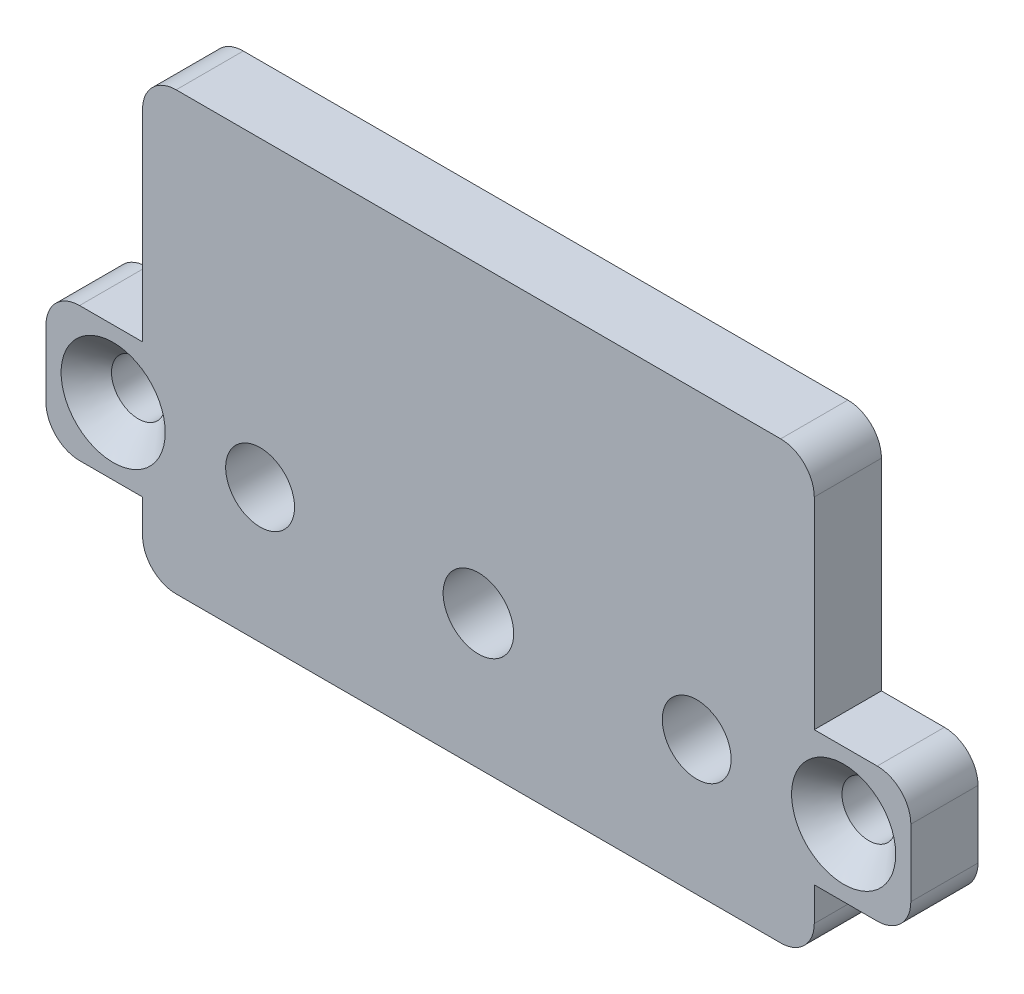
ISO-10303-21;
HEADER;
FILE_DESCRIPTION(('STEP AP214'),'2;1');
FILE_NAME('part.step','',(''),(''),'','','');
FILE_SCHEMA(('AUTOMOTIVE_DESIGN { 1 0 10303 214 1 1 1 1 }'));
ENDSEC;
DATA;
#1=APPLICATION_CONTEXT('core data for automotive mechanical design processes');
#2=APPLICATION_PROTOCOL_DEFINITION('international standard','automotive_design',2000,#1);
#3=PRODUCT_CONTEXT('',#1,'mechanical');
#4=PRODUCT('Part','Part','',(#3));
#5=PRODUCT_RELATED_PRODUCT_CATEGORY('part','',(#4));
#6=PRODUCT_DEFINITION_FORMATION('','',#4);
#7=PRODUCT_DEFINITION_CONTEXT('part definition',#1,'design');
#8=PRODUCT_DEFINITION('design','',#6,#7);
#9=PRODUCT_DEFINITION_SHAPE('','',#8);
#10=(LENGTH_UNIT() NAMED_UNIT(*) SI_UNIT(.MILLI.,.METRE.));
#11=(NAMED_UNIT(*) PLANE_ANGLE_UNIT() SI_UNIT($,.RADIAN.));
#12=(NAMED_UNIT(*) SI_UNIT($,.STERADIAN.) SOLID_ANGLE_UNIT());
#13=UNCERTAINTY_MEASURE_WITH_UNIT(LENGTH_MEASURE(1.E-05),#10,'distance_accuracy_value','');
#14=(GEOMETRIC_REPRESENTATION_CONTEXT(3) GLOBAL_UNCERTAINTY_ASSIGNED_CONTEXT((#13)) GLOBAL_UNIT_ASSIGNED_CONTEXT((#10,
#11,#12)) REPRESENTATION_CONTEXT('',''));
#15=CARTESIAN_POINT('',(0.,0.,0.));
#16=DIRECTION('',(0.,0.,1.));
#17=DIRECTION('',(1.,0.,0.));
#18=AXIS2_PLACEMENT_3D('',#15,#16,#17);
#19=CARTESIAN_POINT('',(0.,0.,4.));
#20=DIRECTION('',(0.,1.,0.));
#21=DIRECTION('',(0.,0.,1.));
#22=AXIS2_PLACEMENT_3D('',#19,#20,#21);
#23=PLANE('',#22);
#24=DIRECTION('',(1.,0.,0.));
#25=VECTOR('',#24,1.);
#26=CARTESIAN_POINT('',(0.,0.,4.));
#27=LINE('',#26,#25);
#28=CARTESIAN_POINT('',(2.,0.,4.));
#29=VERTEX_POINT('',#28);
#30=CARTESIAN_POINT('',(5.75,0.,4.));
#31=VERTEX_POINT('',#30);
#32=EDGE_CURVE('E189',#29,#31,#27,.T.);
#33=ORIENTED_EDGE('',*,*,#32,.F.);
#34=DIRECTION('',(0.,0.,-1.));
#35=VECTOR('',#34,1.);
#36=CARTESIAN_POINT('',(2.,0.,0.));
#37=LINE('',#36,#35);
#38=CARTESIAN_POINT('',(2.,0.,0.));
#39=VERTEX_POINT('',#38);
#40=EDGE_CURVE('E253',#29,#39,#37,.T.);
#41=ORIENTED_EDGE('',*,*,#40,.T.);
#42=DIRECTION('',(1.,0.,0.));
#43=VECTOR('',#42,1.);
#44=CARTESIAN_POINT('',(0.,0.,0.));
#45=LINE('',#44,#43);
#46=CARTESIAN_POINT('',(5.75,0.,0.));
#47=VERTEX_POINT('',#46);
#48=EDGE_CURVE('E206',#39,#47,#45,.T.);
#49=ORIENTED_EDGE('',*,*,#48,.T.);
#50=DIRECTION('',(0.,0.,-1.));
#51=VECTOR('',#50,1.);
#52=CARTESIAN_POINT('',(5.75,0.,4.));
#53=LINE('',#52,#51);
#54=EDGE_CURVE('E185',#31,#47,#53,.T.);
#55=ORIENTED_EDGE('',*,*,#54,.F.);
#56=EDGE_LOOP('',(#33,#41,#49,#55));
#57=FACE_BOUND('',#56,.T.);
#58=ADVANCED_FACE('F43',(#57),#23,.F.);
#59=CARTESIAN_POINT('',(5.75,0.,4.));
#60=DIRECTION('',(-1.,0.,0.));
#61=DIRECTION('',(0.,0.,1.));
#62=AXIS2_PLACEMENT_3D('',#59,#60,#61);
#63=PLANE('',#62);
#64=DIRECTION('',(0.,1.,0.));
#65=VECTOR('',#64,1.);
#66=CARTESIAN_POINT('',(5.75,0.,0.));
#67=LINE('',#66,#65);
#68=CARTESIAN_POINT('',(5.75,-2.,0.));
#69=VERTEX_POINT('',#68);
#70=EDGE_CURVE('E422',#69,#47,#67,.T.);
#71=ORIENTED_EDGE('',*,*,#70,.F.);
#72=DIRECTION('',(0.,0.,-1.));
#73=VECTOR('',#72,1.);
#74=CARTESIAN_POINT('',(5.75,-2.,4.));
#75=LINE('',#74,#73);
#76=CARTESIAN_POINT('',(5.75,-2.,4.));
#77=VERTEX_POINT('',#76);
#78=EDGE_CURVE('E59',#69,#77,#75,.F.);
#79=ORIENTED_EDGE('',*,*,#78,.T.);
#80=DIRECTION('',(0.,1.,0.));
#81=VECTOR('',#80,1.);
#82=CARTESIAN_POINT('',(5.75,0.,4.));
#83=LINE('',#82,#81);
#84=EDGE_CURVE('E181',#77,#31,#83,.T.);
#85=ORIENTED_EDGE('',*,*,#84,.T.);
#86=ORIENTED_EDGE('',*,*,#54,.T.);
#87=EDGE_LOOP('',(#71,#79,#85,#86));
#88=FACE_BOUND('',#87,.T.);
#89=ADVANCED_FACE('F183',(#88),#63,.T.);
#90=CARTESIAN_POINT('',(0.,-4.,4.));
#91=DIRECTION('',(0.,1.,0.));
#92=DIRECTION('',(0.,0.,1.));
#93=AXIS2_PLACEMENT_3D('',#90,#91,#92);
#94=PLANE('',#93);
#95=DIRECTION('',(1.,0.,0.));
#96=VECTOR('',#95,1.);
#97=CARTESIAN_POINT('',(0.,-4.,0.));
#98=LINE('',#97,#96);
#99=CARTESIAN_POINT('',(7.75,-4.,0.));
#100=VERTEX_POINT('',#99);
#101=CARTESIAN_POINT('',(43.75,-4.,0.));
#102=VERTEX_POINT('',#101);
#103=EDGE_CURVE('E418',#100,#102,#98,.T.);
#104=ORIENTED_EDGE('',*,*,#103,.T.);
#105=DIRECTION('',(0.,0.,-1.));
#106=VECTOR('',#105,1.);
#107=CARTESIAN_POINT('',(43.75,-4.,4.));
#108=LINE('',#107,#106);
#109=CARTESIAN_POINT('',(43.75,-4.,4.));
#110=VERTEX_POINT('',#109);
#111=EDGE_CURVE('E302',#102,#110,#108,.F.);
#112=ORIENTED_EDGE('',*,*,#111,.T.);
#113=DIRECTION('',(1.,0.,0.));
#114=VECTOR('',#113,1.);
#115=CARTESIAN_POINT('',(0.,-4.,4.));
#116=LINE('',#115,#114);
#117=CARTESIAN_POINT('',(7.75,-4.,4.));
#118=VERTEX_POINT('',#117);
#119=EDGE_CURVE('E188',#118,#110,#116,.T.);
#120=ORIENTED_EDGE('',*,*,#119,.F.);
#121=DIRECTION('',(0.,0.,-1.));
#122=VECTOR('',#121,1.);
#123=CARTESIAN_POINT('',(7.75,-4.,0.));
#124=LINE('',#123,#122);
#125=EDGE_CURVE('E298',#118,#100,#124,.T.);
#126=ORIENTED_EDGE('',*,*,#125,.T.);
#127=EDGE_LOOP('',(#104,#112,#120,#126));
#128=FACE_BOUND('',#127,.T.);
#129=ADVANCED_FACE('F509',(#128),#94,.F.);
#130=CARTESIAN_POINT('',(45.75,0.,4.));
#131=DIRECTION('',(-1.,0.,0.));
#132=DIRECTION('',(0.,0.,1.));
#133=AXIS2_PLACEMENT_3D('',#130,#131,#132);
#134=PLANE('',#133);
#135=DIRECTION('',(0.,1.,0.));
#136=VECTOR('',#135,1.);
#137=CARTESIAN_POINT('',(45.75,0.,4.));
#138=LINE('',#137,#136);
#139=CARTESIAN_POINT('',(45.75,-2.,4.));
#140=VERTEX_POINT('',#139);
#141=CARTESIAN_POINT('',(45.75,0.,4.));
#142=VERTEX_POINT('',#141);
#143=EDGE_CURVE('E464',#140,#142,#138,.T.);
#144=ORIENTED_EDGE('',*,*,#143,.F.);
#145=DIRECTION('',(0.,0.,-1.));
#146=VECTOR('',#145,1.);
#147=CARTESIAN_POINT('',(45.75,-2.,4.));
#148=LINE('',#147,#146);
#149=CARTESIAN_POINT('',(45.75,-2.,0.));
#150=VERTEX_POINT('',#149);
#151=EDGE_CURVE('E282',#140,#150,#148,.T.);
#152=ORIENTED_EDGE('',*,*,#151,.T.);
#153=DIRECTION('',(0.,1.,0.));
#154=VECTOR('',#153,1.);
#155=CARTESIAN_POINT('',(45.75,0.,0.));
#156=LINE('',#155,#154);
#157=CARTESIAN_POINT('',(45.75,0.,0.));
#158=VERTEX_POINT('',#157);
#159=EDGE_CURVE('E415',#150,#158,#156,.T.);
#160=ORIENTED_EDGE('',*,*,#159,.T.);
#161=DIRECTION('',(0.,0.,-1.));
#162=VECTOR('',#161,1.);
#163=CARTESIAN_POINT('',(45.75,0.,4.));
#164=LINE('',#163,#162);
#165=EDGE_CURVE('E209',#142,#158,#164,.T.);
#166=ORIENTED_EDGE('',*,*,#165,.F.);
#167=EDGE_LOOP('',(#144,#152,#160,#166));
#168=FACE_BOUND('',#167,.T.);
#169=ADVANCED_FACE('F478',(#168),#134,.F.);
#170=CARTESIAN_POINT('',(0.,0.,4.));
#171=DIRECTION('',(0.,1.,0.));
#172=DIRECTION('',(0.,0.,1.));
#173=AXIS2_PLACEMENT_3D('',#170,#171,#172);
#174=PLANE('',#173);
#175=DIRECTION('',(1.,0.,0.));
#176=VECTOR('',#175,1.);
#177=CARTESIAN_POINT('',(0.,0.,0.));
#178=LINE('',#177,#176);
#179=CARTESIAN_POINT('',(49.5,0.,0.));
#180=VERTEX_POINT('',#179);
#181=EDGE_CURVE('E409',#158,#180,#178,.T.);
#182=ORIENTED_EDGE('',*,*,#181,.T.);
#183=DIRECTION('',(0.,0.,-1.));
#184=VECTOR('',#183,1.);
#185=CARTESIAN_POINT('',(49.5,0.,4.));
#186=LINE('',#185,#184);
#187=CARTESIAN_POINT('',(49.5,0.,4.));
#188=VERTEX_POINT('',#187);
#189=EDGE_CURVE('E235',#180,#188,#186,.F.);
#190=ORIENTED_EDGE('',*,*,#189,.T.);
#191=DIRECTION('',(1.,0.,0.));
#192=VECTOR('',#191,1.);
#193=CARTESIAN_POINT('',(0.,0.,4.));
#194=LINE('',#193,#192);
#195=EDGE_CURVE('E460',#142,#188,#194,.T.);
#196=ORIENTED_EDGE('',*,*,#195,.F.);
#197=ORIENTED_EDGE('',*,*,#165,.T.);
#198=EDGE_LOOP('',(#182,#190,#196,#197));
#199=FACE_BOUND('',#198,.T.);
#200=ADVANCED_FACE('F485',(#199),#174,.F.);
#201=CARTESIAN_POINT('',(51.5,0.,4.));
#202=DIRECTION('',(-1.,0.,0.));
#203=DIRECTION('',(0.,0.,1.));
#204=AXIS2_PLACEMENT_3D('',#201,#202,#203);
#205=PLANE('',#204);
#206=DIRECTION('',(0.,1.,0.));
#207=VECTOR('',#206,1.);
#208=CARTESIAN_POINT('',(51.5,0.,4.));
#209=LINE('',#208,#207);
#210=CARTESIAN_POINT('',(51.5,2.,4.));
#211=VERTEX_POINT('',#210);
#212=CARTESIAN_POINT('',(51.5,6.,4.));
#213=VERTEX_POINT('',#212);
#214=EDGE_CURVE('E456',#211,#213,#209,.T.);
#215=ORIENTED_EDGE('',*,*,#214,.F.);
#216=DIRECTION('',(0.,0.,-1.));
#217=VECTOR('',#216,1.);
#218=CARTESIAN_POINT('',(51.5,2.,4.));
#219=LINE('',#218,#217);
#220=CARTESIAN_POINT('',(51.5,2.,0.));
#221=VERTEX_POINT('',#220);
#222=EDGE_CURVE('E213',#211,#221,#219,.T.);
#223=ORIENTED_EDGE('',*,*,#222,.T.);
#224=DIRECTION('',(0.,1.,0.));
#225=VECTOR('',#224,1.);
#226=CARTESIAN_POINT('',(51.5,0.,0.));
#227=LINE('',#226,#225);
#228=CARTESIAN_POINT('',(51.5,6.,0.));
#229=VERTEX_POINT('',#228);
#230=EDGE_CURVE('E405',#221,#229,#227,.T.);
#231=ORIENTED_EDGE('',*,*,#230,.T.);
#232=DIRECTION('',(0.,0.,-1.));
#233=VECTOR('',#232,1.);
#234=CARTESIAN_POINT('',(51.5,6.,4.));
#235=LINE('',#234,#233);
#236=EDGE_CURVE('E208',#229,#213,#235,.F.);
#237=ORIENTED_EDGE('',*,*,#236,.T.);
#238=EDGE_LOOP('',(#215,#223,#231,#237));
#239=FACE_BOUND('',#238,.T.);
#240=ADVANCED_FACE('F494',(#239),#205,.F.);
#241=CARTESIAN_POINT('',(0.,8.,4.));
#242=DIRECTION('',(0.,1.,0.));
#243=DIRECTION('',(0.,0.,1.));
#244=AXIS2_PLACEMENT_3D('',#241,#242,#243);
#245=PLANE('',#244);
#246=DIRECTION('',(1.,0.,0.));
#247=VECTOR('',#246,1.);
#248=CARTESIAN_POINT('',(0.,8.,4.));
#249=LINE('',#248,#247);
#250=CARTESIAN_POINT('',(45.75,8.,4.));
#251=VERTEX_POINT('',#250);
#252=CARTESIAN_POINT('',(49.5,8.,4.));
#253=VERTEX_POINT('',#252);
#254=EDGE_CURVE('E453',#251,#253,#249,.T.);
#255=ORIENTED_EDGE('',*,*,#254,.T.);
#256=DIRECTION('',(0.,0.,-1.));
#257=VECTOR('',#256,1.);
#258=CARTESIAN_POINT('',(49.5,8.,0.));
#259=LINE('',#258,#257);
#260=CARTESIAN_POINT('',(49.5,8.,0.));
#261=VERTEX_POINT('',#260);
#262=EDGE_CURVE('E249',#253,#261,#259,.T.);
#263=ORIENTED_EDGE('',*,*,#262,.T.);
#264=DIRECTION('',(1.,0.,0.));
#265=VECTOR('',#264,1.);
#266=CARTESIAN_POINT('',(0.,8.,0.));
#267=LINE('',#266,#265);
#268=CARTESIAN_POINT('',(45.75,8.,0.));
#269=VERTEX_POINT('',#268);
#270=EDGE_CURVE('E400',#269,#261,#267,.T.);
#271=ORIENTED_EDGE('',*,*,#270,.F.);
#272=DIRECTION('',(0.,0.,-1.));
#273=VECTOR('',#272,1.);
#274=CARTESIAN_POINT('',(45.75,8.,4.));
#275=LINE('',#274,#273);
#276=EDGE_CURVE('E216',#251,#269,#275,.T.);
#277=ORIENTED_EDGE('',*,*,#276,.F.);
#278=EDGE_LOOP('',(#255,#263,#271,#277));
#279=FACE_BOUND('',#278,.T.);
#280=ADVANCED_FACE('F402',(#279),#245,.T.);
#281=CARTESIAN_POINT('',(45.75,0.,4.));
#282=DIRECTION('',(-1.,0.,0.));
#283=DIRECTION('',(0.,0.,1.));
#284=AXIS2_PLACEMENT_3D('',#281,#282,#283);
#285=PLANE('',#284);
#286=DIRECTION('',(0.,1.,0.));
#287=VECTOR('',#286,1.);
#288=CARTESIAN_POINT('',(45.75,0.,0.));
#289=LINE('',#288,#287);
#290=CARTESIAN_POINT('',(45.75,20.,0.));
#291=VERTEX_POINT('',#290);
#292=EDGE_CURVE('E363',#269,#291,#289,.T.);
#293=ORIENTED_EDGE('',*,*,#292,.T.);
#294=DIRECTION('',(0.,0.,-1.));
#295=VECTOR('',#294,1.);
#296=CARTESIAN_POINT('',(45.75,20.,4.));
#297=LINE('',#296,#295);
#298=CARTESIAN_POINT('',(45.75,20.,4.));
#299=VERTEX_POINT('',#298);
#300=EDGE_CURVE('E11',#291,#299,#297,.F.);
#301=ORIENTED_EDGE('',*,*,#300,.T.);
#302=DIRECTION('',(0.,1.,0.));
#303=VECTOR('',#302,1.);
#304=CARTESIAN_POINT('',(45.75,0.,4.));
#305=LINE('',#304,#303);
#306=EDGE_CURVE('E340',#251,#299,#305,.T.);
#307=ORIENTED_EDGE('',*,*,#306,.F.);
#308=ORIENTED_EDGE('',*,*,#276,.T.);
#309=EDGE_LOOP('',(#293,#301,#307,#308));
#310=FACE_BOUND('',#309,.T.);
#311=ADVANCED_FACE('F393',(#310),#285,.F.);
#312=CARTESIAN_POINT('',(0.,22.,4.));
#313=DIRECTION('',(0.,1.,0.));
#314=DIRECTION('',(0.,0.,1.));
#315=AXIS2_PLACEMENT_3D('',#312,#313,#314);
#316=PLANE('',#315);
#317=DIRECTION('',(1.,0.,0.));
#318=VECTOR('',#317,1.);
#319=CARTESIAN_POINT('',(0.,22.,0.));
#320=LINE('',#319,#318);
#321=CARTESIAN_POINT('',(7.75,22.,0.));
#322=VERTEX_POINT('',#321);
#323=CARTESIAN_POINT('',(43.75,22.,0.));
#324=VERTEX_POINT('',#323);
#325=EDGE_CURVE('E334',#322,#324,#320,.T.);
#326=ORIENTED_EDGE('',*,*,#325,.F.);
#327=DIRECTION('',(0.,0.,-1.));
#328=VECTOR('',#327,1.);
#329=CARTESIAN_POINT('',(7.75,22.,4.));
#330=LINE('',#329,#328);
#331=CARTESIAN_POINT('',(7.75,22.,4.));
#332=VERTEX_POINT('',#331);
#333=EDGE_CURVE('E52',#322,#332,#330,.F.);
#334=ORIENTED_EDGE('',*,*,#333,.T.);
#335=DIRECTION('',(1.,0.,0.));
#336=VECTOR('',#335,1.);
#337=CARTESIAN_POINT('',(0.,22.,4.));
#338=LINE('',#337,#336);
#339=CARTESIAN_POINT('',(43.75,22.,4.));
#340=VERTEX_POINT('',#339);
#341=EDGE_CURVE('E331',#332,#340,#338,.T.);
#342=ORIENTED_EDGE('',*,*,#341,.T.);
#343=DIRECTION('',(0.,0.,-1.));
#344=VECTOR('',#343,1.);
#345=CARTESIAN_POINT('',(43.75,22.,0.));
#346=LINE('',#345,#344);
#347=EDGE_CURVE('E322',#340,#324,#346,.T.);
#348=ORIENTED_EDGE('',*,*,#347,.T.);
#349=EDGE_LOOP('',(#326,#334,#342,#348));
#350=FACE_BOUND('',#349,.T.);
#351=ADVANCED_FACE('F330',(#350),#316,.T.);
#352=CARTESIAN_POINT('',(5.75,0.,4.));
#353=DIRECTION('',(-1.,0.,0.));
#354=DIRECTION('',(0.,0.,1.));
#355=AXIS2_PLACEMENT_3D('',#352,#353,#354);
#356=PLANE('',#355);
#357=DIRECTION('',(0.,1.,0.));
#358=VECTOR('',#357,1.);
#359=CARTESIAN_POINT('',(5.75,0.,4.));
#360=LINE('',#359,#358);
#361=CARTESIAN_POINT('',(5.75,8.,4.));
#362=VERTEX_POINT('',#361);
#363=CARTESIAN_POINT('',(5.75,20.,4.));
#364=VERTEX_POINT('',#363);
#365=EDGE_CURVE('E339',#362,#364,#360,.T.);
#366=ORIENTED_EDGE('',*,*,#365,.T.);
#367=DIRECTION('',(0.,0.,-1.));
#368=VECTOR('',#367,1.);
#369=CARTESIAN_POINT('',(5.75,20.,4.));
#370=LINE('',#369,#368);
#371=CARTESIAN_POINT('',(5.75,20.,0.));
#372=VERTEX_POINT('',#371);
#373=EDGE_CURVE('E318',#364,#372,#370,.T.);
#374=ORIENTED_EDGE('',*,*,#373,.T.);
#375=DIRECTION('',(0.,1.,0.));
#376=VECTOR('',#375,1.);
#377=CARTESIAN_POINT('',(5.75,0.,0.));
#378=LINE('',#377,#376);
#379=CARTESIAN_POINT('',(5.75,8.,0.));
#380=VERTEX_POINT('',#379);
#381=EDGE_CURVE('E349',#380,#372,#378,.T.);
#382=ORIENTED_EDGE('',*,*,#381,.F.);
#383=DIRECTION('',(0.,0.,-1.));
#384=VECTOR('',#383,1.);
#385=CARTESIAN_POINT('',(5.75,8.,4.));
#386=LINE('',#385,#384);
#387=EDGE_CURVE('E385',#362,#380,#386,.T.);
#388=ORIENTED_EDGE('',*,*,#387,.F.);
#389=EDGE_LOOP('',(#366,#374,#382,#388));
#390=FACE_BOUND('',#389,.T.);
#391=ADVANCED_FACE('F347',(#390),#356,.T.);
#392=CARTESIAN_POINT('',(0.,8.,4.));
#393=DIRECTION('',(0.,1.,0.));
#394=DIRECTION('',(0.,0.,1.));
#395=AXIS2_PLACEMENT_3D('',#392,#393,#394);
#396=PLANE('',#395);
#397=DIRECTION('',(1.,0.,0.));
#398=VECTOR('',#397,1.);
#399=CARTESIAN_POINT('',(0.,8.,0.));
#400=LINE('',#399,#398);
#401=CARTESIAN_POINT('',(2.,8.,0.));
#402=VERTEX_POINT('',#401);
#403=EDGE_CURVE('E355',#402,#380,#400,.T.);
#404=ORIENTED_EDGE('',*,*,#403,.F.);
#405=DIRECTION('',(0.,0.,-1.));
#406=VECTOR('',#405,1.);
#407=CARTESIAN_POINT('',(2.,8.,4.));
#408=LINE('',#407,#406);
#409=CARTESIAN_POINT('',(2.,8.,4.));
#410=VERTEX_POINT('',#409);
#411=EDGE_CURVE('E263',#402,#410,#408,.F.);
#412=ORIENTED_EDGE('',*,*,#411,.T.);
#413=DIRECTION('',(1.,0.,0.));
#414=VECTOR('',#413,1.);
#415=CARTESIAN_POINT('',(0.,8.,4.));
#416=LINE('',#415,#414);
#417=EDGE_CURVE('E446',#410,#362,#416,.T.);
#418=ORIENTED_EDGE('',*,*,#417,.T.);
#419=ORIENTED_EDGE('',*,*,#387,.T.);
#420=EDGE_LOOP('',(#404,#412,#418,#419));
#421=FACE_BOUND('',#420,.T.);
#422=ADVANCED_FACE('F552',(#421),#396,.T.);
#423=CARTESIAN_POINT('',(38.75,4.,4.));
#424=DIRECTION('',(0.,0.,-1.));
#425=DIRECTION('',(-1.,0.,0.));
#426=AXIS2_PLACEMENT_3D('',#423,#424,#425);
#427=CYLINDRICAL_SURFACE('',#426,2.05);
#428=CARTESIAN_POINT('',(38.75,4.,4.));
#429=DIRECTION('',(0.,0.,1.));
#430=DIRECTION('',(1.,0.,0.));
#431=AXIS2_PLACEMENT_3D('',#428,#429,#430);
#432=CIRCLE('',#431,2.05);
#433=CARTESIAN_POINT('',(40.8,4.,4.));
#434=VERTEX_POINT('',#433);
#435=EDGE_CURVE('E387',#434,#434,#432,.T.);
#436=ORIENTED_EDGE('',*,*,#435,.T.);
#437=EDGE_LOOP('',(#436));
#438=FACE_BOUND('',#437,.T.);
#439=CARTESIAN_POINT('',(38.75,4.,0.));
#440=DIRECTION('',(0.,0.,1.));
#441=DIRECTION('',(1.,0.,0.));
#442=AXIS2_PLACEMENT_3D('',#439,#440,#441);
#443=CIRCLE('',#442,2.05);
#444=CARTESIAN_POINT('',(40.8,4.,0.));
#445=VERTEX_POINT('',#444);
#446=EDGE_CURVE('E378',#445,#445,#443,.T.);
#447=ORIENTED_EDGE('',*,*,#446,.F.);
#448=EDGE_LOOP('',(#447));
#449=FACE_BOUND('',#448,.T.);
#450=ADVANCED_FACE('F555',(#438,#449),#427,.F.);
#451=CARTESIAN_POINT('',(12.75,4.,4.));
#452=DIRECTION('',(0.,0.,-1.));
#453=DIRECTION('',(-1.,0.,0.));
#454=AXIS2_PLACEMENT_3D('',#451,#452,#453);
#455=CYLINDRICAL_SURFACE('',#454,2.05);
#456=CARTESIAN_POINT('',(12.75,4.,4.));
#457=DIRECTION('',(0.,0.,1.));
#458=DIRECTION('',(1.,0.,0.));
#459=AXIS2_PLACEMENT_3D('',#456,#457,#458);
#460=CIRCLE('',#459,2.05);
#461=CARTESIAN_POINT('',(14.8,4.,4.));
#462=VERTEX_POINT('',#461);
#463=EDGE_CURVE('E434',#462,#462,#460,.T.);
#464=ORIENTED_EDGE('',*,*,#463,.T.);
#465=EDGE_LOOP('',(#464));
#466=FACE_BOUND('',#465,.T.);
#467=CARTESIAN_POINT('',(12.75,4.,0.));
#468=DIRECTION('',(0.,0.,1.));
#469=DIRECTION('',(1.,0.,0.));
#470=AXIS2_PLACEMENT_3D('',#467,#468,#469);
#471=CIRCLE('',#470,2.05);
#472=CARTESIAN_POINT('',(14.8,4.,0.));
#473=VERTEX_POINT('',#472);
#474=EDGE_CURVE('E374',#473,#473,#471,.T.);
#475=ORIENTED_EDGE('',*,*,#474,.F.);
#476=EDGE_LOOP('',(#475));
#477=FACE_BOUND('',#476,.T.);
#478=ADVANCED_FACE('F561',(#466,#477),#455,.F.);
#479=CARTESIAN_POINT('',(25.75,4.,4.));
#480=DIRECTION('',(0.,0.,-1.));
#481=DIRECTION('',(-1.,0.,0.));
#482=AXIS2_PLACEMENT_3D('',#479,#480,#481);
#483=CYLINDRICAL_SURFACE('',#482,2.1);
#484=CARTESIAN_POINT('',(25.75,4.,4.));
#485=DIRECTION('',(0.,0.,1.));
#486=DIRECTION('',(1.,0.,0.));
#487=AXIS2_PLACEMENT_3D('',#484,#485,#486);
#488=CIRCLE('',#487,2.1);
#489=CARTESIAN_POINT('',(27.85,4.,4.));
#490=VERTEX_POINT('',#489);
#491=EDGE_CURVE('E438',#490,#490,#488,.T.);
#492=ORIENTED_EDGE('',*,*,#491,.T.);
#493=EDGE_LOOP('',(#492));
#494=FACE_BOUND('',#493,.T.);
#495=CARTESIAN_POINT('',(25.75,4.,0.));
#496=DIRECTION('',(0.,0.,1.));
#497=DIRECTION('',(1.,0.,0.));
#498=AXIS2_PLACEMENT_3D('',#495,#496,#497);
#499=CIRCLE('',#498,2.1);
#500=CARTESIAN_POINT('',(27.85,4.,0.));
#501=VERTEX_POINT('',#500);
#502=EDGE_CURVE('E370',#501,#501,#499,.T.);
#503=ORIENTED_EDGE('',*,*,#502,.F.);
#504=EDGE_LOOP('',(#503));
#505=FACE_BOUND('',#504,.T.);
#506=ADVANCED_FACE('F691',(#494,#505),#483,.F.);
#507=CARTESIAN_POINT('',(0.,0.,4.));
#508=DIRECTION('',(-1.,0.,0.));
#509=DIRECTION('',(0.,0.,1.));
#510=AXIS2_PLACEMENT_3D('',#507,#508,#509);
#511=PLANE('',#510);
#512=DIRECTION('',(0.,1.,0.));
#513=VECTOR('',#512,1.);
#514=CARTESIAN_POINT('',(0.,0.,0.));
#515=LINE('',#514,#513);
#516=CARTESIAN_POINT('',(0.,2.,0.));
#517=VERTEX_POINT('',#516);
#518=CARTESIAN_POINT('',(0.,6.,0.));
#519=VERTEX_POINT('',#518);
#520=EDGE_CURVE('E361',#517,#519,#515,.T.);
#521=ORIENTED_EDGE('',*,*,#520,.F.);
#522=DIRECTION('',(0.,0.,-1.));
#523=VECTOR('',#522,1.);
#524=CARTESIAN_POINT('',(0.,2.,4.));
#525=LINE('',#524,#523);
#526=CARTESIAN_POINT('',(0.,2.,4.));
#527=VERTEX_POINT('',#526);
#528=EDGE_CURVE('E260',#517,#527,#525,.F.);
#529=ORIENTED_EDGE('',*,*,#528,.T.);
#530=DIRECTION('',(0.,1.,0.));
#531=VECTOR('',#530,1.);
#532=CARTESIAN_POINT('',(0.,0.,4.));
#533=LINE('',#532,#531);
#534=CARTESIAN_POINT('',(0.,6.,4.));
#535=VERTEX_POINT('',#534);
#536=EDGE_CURVE('E442',#527,#535,#533,.T.);
#537=ORIENTED_EDGE('',*,*,#536,.T.);
#538=DIRECTION('',(0.,0.,-1.));
#539=VECTOR('',#538,1.);
#540=CARTESIAN_POINT('',(0.,6.,4.));
#541=LINE('',#540,#539);
#542=EDGE_CURVE('E256',#535,#519,#541,.T.);
#543=ORIENTED_EDGE('',*,*,#542,.T.);
#544=EDGE_LOOP('',(#521,#529,#537,#543));
#545=FACE_BOUND('',#544,.T.);
#546=ADVANCED_FACE('F517',(#545),#511,.T.);
#547=CARTESIAN_POINT('',(4.,4.,4.));
#548=DIRECTION('',(0.,0.,-1.));
#549=DIRECTION('',(-1.,0.,0.));
#550=AXIS2_PLACEMENT_3D('',#547,#548,#549);
#551=CYLINDRICAL_SURFACE('',#550,1.6);
#552=CARTESIAN_POINT('',(4.,4.,2.5));
#553=DIRECTION('',(0.,0.,1.));
#554=DIRECTION('',(1.,0.,0.));
#555=AXIS2_PLACEMENT_3D('',#552,#553,#554);
#556=CIRCLE('',#555,1.6);
#557=CARTESIAN_POINT('',(5.6,4.,2.5));
#558=VERTEX_POINT('',#557);
#559=EDGE_CURVE('E278',#558,#558,#556,.T.);
#560=ORIENTED_EDGE('',*,*,#559,.T.);
#561=EDGE_LOOP('',(#560));
#562=FACE_BOUND('',#561,.T.);
#563=CARTESIAN_POINT('',(4.,4.,0.));
#564=DIRECTION('',(0.,0.,1.));
#565=DIRECTION('',(1.,0.,0.));
#566=AXIS2_PLACEMENT_3D('',#563,#564,#565);
#567=CIRCLE('',#566,1.6);
#568=CARTESIAN_POINT('',(5.6,4.,0.));
#569=VERTEX_POINT('',#568);
#570=EDGE_CURVE('E427',#569,#569,#567,.T.);
#571=ORIENTED_EDGE('',*,*,#570,.F.);
#572=EDGE_LOOP('',(#571));
#573=FACE_BOUND('',#572,.T.);
#574=ADVANCED_FACE('F513',(#562,#573),#551,.F.);
#575=CARTESIAN_POINT('',(47.5,4.,4.));
#576=DIRECTION('',(0.,0.,-1.));
#577=DIRECTION('',(-1.,0.,0.));
#578=AXIS2_PLACEMENT_3D('',#575,#576,#577);
#579=CYLINDRICAL_SURFACE('',#578,1.6);
#580=CARTESIAN_POINT('',(47.5,4.,2.5));
#581=DIRECTION('',(0.,0.,1.));
#582=DIRECTION('',(1.,0.,0.));
#583=AXIS2_PLACEMENT_3D('',#580,#581,#582);
#584=CIRCLE('',#583,1.6);
#585=CARTESIAN_POINT('',(49.1,4.,2.5));
#586=VERTEX_POINT('',#585);
#587=EDGE_CURVE('E266',#586,#586,#584,.T.);
#588=ORIENTED_EDGE('',*,*,#587,.T.);
#589=EDGE_LOOP('',(#588));
#590=FACE_BOUND('',#589,.T.);
#591=CARTESIAN_POINT('',(47.5,4.,0.));
#592=DIRECTION('',(0.,0.,1.));
#593=DIRECTION('',(1.,0.,0.));
#594=AXIS2_PLACEMENT_3D('',#591,#592,#593);
#595=CIRCLE('',#594,1.6);
#596=CARTESIAN_POINT('',(49.1,4.,0.));
#597=VERTEX_POINT('',#596);
#598=EDGE_CURVE('E202',#597,#597,#595,.T.);
#599=ORIENTED_EDGE('',*,*,#598,.F.);
#600=EDGE_LOOP('',(#599));
#601=FACE_BOUND('',#600,.T.);
#602=ADVANCED_FACE('F516',(#590,#601),#579,.F.);
#603=CARTESIAN_POINT('',(0.,0.,4.));
#604=DIRECTION('',(0.,0.,1.));
#605=DIRECTION('',(1.,0.,0.));
#606=AXIS2_PLACEMENT_3D('',#603,#604,#605);
#607=PLANE('',#606);
#608=CARTESIAN_POINT('',(47.5,4.,4.));
#609=DIRECTION('',(0.,0.,1.));
#610=DIRECTION('',(1.,0.,0.));
#611=AXIS2_PLACEMENT_3D('',#608,#609,#610);
#612=CIRCLE('',#611,3.10000000000001);
#613=CARTESIAN_POINT('',(50.6,4.,4.));
#614=VERTEX_POINT('',#613);
#615=EDGE_CURVE('E274',#614,#614,#612,.F.);
#616=ORIENTED_EDGE('',*,*,#615,.T.);
#617=EDGE_LOOP('',(#616));
#618=FACE_BOUND('',#617,.T.);
#619=CARTESIAN_POINT('',(4.,4.,4.));
#620=DIRECTION('',(0.,0.,1.));
#621=DIRECTION('',(1.,0.,0.));
#622=AXIS2_PLACEMENT_3D('',#619,#620,#621);
#623=CIRCLE('',#622,3.10000000000001);
#624=CARTESIAN_POINT('',(7.10000000000001,4.,4.));
#625=VERTEX_POINT('',#624);
#626=EDGE_CURVE('E270',#625,#625,#623,.F.);
#627=ORIENTED_EDGE('',*,*,#626,.T.);
#628=EDGE_LOOP('',(#627));
#629=FACE_BOUND('',#628,.T.);
#630=ORIENTED_EDGE('',*,*,#119,.T.);
#631=CARTESIAN_POINT('',(43.75,-2.,4.));
#632=DIRECTION('',(0.,0.,1.));
#633=DIRECTION('',(1.,0.,0.));
#634=AXIS2_PLACEMENT_3D('',#631,#632,#633);
#635=CIRCLE('',#634,2.);
#636=EDGE_CURVE('E313',#110,#140,#635,.T.);
#637=ORIENTED_EDGE('',*,*,#636,.T.);
#638=ORIENTED_EDGE('',*,*,#143,.T.);
#639=ORIENTED_EDGE('',*,*,#195,.T.);
#640=CARTESIAN_POINT('',(49.5,2.,4.));
#641=DIRECTION('',(0.,0.,1.));
#642=DIRECTION('',(1.,0.,0.));
#643=AXIS2_PLACEMENT_3D('',#640,#641,#642);
#644=CIRCLE('',#643,2.);
#645=EDGE_CURVE('E246',#188,#211,#644,.T.);
#646=ORIENTED_EDGE('',*,*,#645,.T.);
#647=ORIENTED_EDGE('',*,*,#214,.T.);
#648=CARTESIAN_POINT('',(49.5,6.,4.));
#649=DIRECTION('',(0.,0.,1.));
#650=DIRECTION('',(1.,0.,0.));
#651=AXIS2_PLACEMENT_3D('',#648,#649,#650);
#652=CIRCLE('',#651,2.);
#653=EDGE_CURVE('E243',#213,#253,#652,.T.);
#654=ORIENTED_EDGE('',*,*,#653,.T.);
#655=ORIENTED_EDGE('',*,*,#254,.F.);
#656=ORIENTED_EDGE('',*,*,#306,.T.);
#657=CARTESIAN_POINT('',(43.75,20.,4.));
#658=DIRECTION('',(0.,0.,1.));
#659=DIRECTION('',(1.,0.,0.));
#660=AXIS2_PLACEMENT_3D('',#657,#658,#659);
#661=CIRCLE('',#660,2.);
#662=EDGE_CURVE('E305',#299,#340,#661,.T.);
#663=ORIENTED_EDGE('',*,*,#662,.T.);
#664=ORIENTED_EDGE('',*,*,#341,.F.);
#665=CARTESIAN_POINT('',(7.75,20.,4.));
#666=DIRECTION('',(0.,0.,1.));
#667=DIRECTION('',(1.,0.,0.));
#668=AXIS2_PLACEMENT_3D('',#665,#666,#667);
#669=CIRCLE('',#668,2.);
#670=EDGE_CURVE('E67',#332,#364,#669,.T.);
#671=ORIENTED_EDGE('',*,*,#670,.T.);
#672=ORIENTED_EDGE('',*,*,#365,.F.);
#673=ORIENTED_EDGE('',*,*,#417,.F.);
#674=CARTESIAN_POINT('',(2.,6.,4.));
#675=DIRECTION('',(0.,0.,1.));
#676=DIRECTION('',(1.,0.,0.));
#677=AXIS2_PLACEMENT_3D('',#674,#675,#676);
#678=CIRCLE('',#677,2.);
#679=EDGE_CURVE('E238',#410,#535,#678,.T.);
#680=ORIENTED_EDGE('',*,*,#679,.T.);
#681=ORIENTED_EDGE('',*,*,#536,.F.);
#682=CARTESIAN_POINT('',(2.,2.,4.));
#683=DIRECTION('',(0.,0.,1.));
#684=DIRECTION('',(1.,0.,0.));
#685=AXIS2_PLACEMENT_3D('',#682,#683,#684);
#686=CIRCLE('',#685,2.);
#687=EDGE_CURVE('E197',#527,#29,#686,.T.);
#688=ORIENTED_EDGE('',*,*,#687,.T.);
#689=ORIENTED_EDGE('',*,*,#32,.T.);
#690=ORIENTED_EDGE('',*,*,#84,.F.);
#691=CARTESIAN_POINT('',(7.75,-2.,4.));
#692=DIRECTION('',(0.,0.,1.));
#693=DIRECTION('',(1.,0.,0.));
#694=AXIS2_PLACEMENT_3D('',#691,#692,#693);
#695=CIRCLE('',#694,2.);
#696=EDGE_CURVE('E310',#77,#118,#695,.T.);
#697=ORIENTED_EDGE('',*,*,#696,.T.);
#698=EDGE_LOOP('',(#630,#637,#638,#639,#646,#647,#654,#655,#656,#663,#664,#671,#672,#673,#680,
#681,#688,#689,#690,#697));
#699=FACE_BOUND('',#698,.T.);
#700=ORIENTED_EDGE('',*,*,#491,.F.);
#701=EDGE_LOOP('',(#700));
#702=FACE_BOUND('',#701,.T.);
#703=ORIENTED_EDGE('',*,*,#463,.F.);
#704=EDGE_LOOP('',(#703));
#705=FACE_BOUND('',#704,.T.);
#706=ORIENTED_EDGE('',*,*,#435,.F.);
#707=EDGE_LOOP('',(#706));
#708=FACE_BOUND('',#707,.T.);
#709=ADVANCED_FACE('F193',(#618,#629,#699,#702,#705,#708),#607,.T.);
#710=CARTESIAN_POINT('',(0.,0.,0.));
#711=DIRECTION('',(0.,0.,1.));
#712=DIRECTION('',(1.,0.,0.));
#713=AXIS2_PLACEMENT_3D('',#710,#711,#712);
#714=PLANE('',#713);
#715=ORIENTED_EDGE('',*,*,#570,.T.);
#716=EDGE_LOOP('',(#715));
#717=FACE_BOUND('',#716,.T.);
#718=ORIENTED_EDGE('',*,*,#159,.F.);
#719=CARTESIAN_POINT('',(43.75,-2.,0.));
#720=DIRECTION('',(0.,0.,1.));
#721=DIRECTION('',(1.,0.,0.));
#722=AXIS2_PLACEMENT_3D('',#719,#720,#721);
#723=CIRCLE('',#722,2.);
#724=EDGE_CURVE('E295',#150,#102,#723,.F.);
#725=ORIENTED_EDGE('',*,*,#724,.T.);
#726=ORIENTED_EDGE('',*,*,#103,.F.);
#727=CARTESIAN_POINT('',(7.75,-2.,0.));
#728=DIRECTION('',(0.,0.,1.));
#729=DIRECTION('',(1.,0.,0.));
#730=AXIS2_PLACEMENT_3D('',#727,#728,#729);
#731=CIRCLE('',#730,2.);
#732=EDGE_CURVE('E292',#100,#69,#731,.F.);
#733=ORIENTED_EDGE('',*,*,#732,.T.);
#734=ORIENTED_EDGE('',*,*,#70,.T.);
#735=ORIENTED_EDGE('',*,*,#48,.F.);
#736=CARTESIAN_POINT('',(2.,2.,0.));
#737=DIRECTION('',(0.,0.,1.));
#738=DIRECTION('',(1.,0.,0.));
#739=AXIS2_PLACEMENT_3D('',#736,#737,#738);
#740=CIRCLE('',#739,2.);
#741=EDGE_CURVE('E226',#39,#517,#740,.F.);
#742=ORIENTED_EDGE('',*,*,#741,.T.);
#743=ORIENTED_EDGE('',*,*,#520,.T.);
#744=CARTESIAN_POINT('',(2.,6.,0.));
#745=DIRECTION('',(0.,0.,1.));
#746=DIRECTION('',(1.,0.,0.));
#747=AXIS2_PLACEMENT_3D('',#744,#745,#746);
#748=CIRCLE('',#747,2.);
#749=EDGE_CURVE('E223',#519,#402,#748,.F.);
#750=ORIENTED_EDGE('',*,*,#749,.T.);
#751=ORIENTED_EDGE('',*,*,#403,.T.);
#752=ORIENTED_EDGE('',*,*,#381,.T.);
#753=CARTESIAN_POINT('',(7.75,20.,0.));
#754=DIRECTION('',(0.,0.,1.));
#755=DIRECTION('',(1.,0.,0.));
#756=AXIS2_PLACEMENT_3D('',#753,#754,#755);
#757=CIRCLE('',#756,2.);
#758=EDGE_CURVE('E289',#372,#322,#757,.F.);
#759=ORIENTED_EDGE('',*,*,#758,.T.);
#760=ORIENTED_EDGE('',*,*,#325,.T.);
#761=CARTESIAN_POINT('',(43.75,20.,0.));
#762=DIRECTION('',(0.,0.,1.));
#763=DIRECTION('',(1.,0.,0.));
#764=AXIS2_PLACEMENT_3D('',#761,#762,#763);
#765=CIRCLE('',#764,2.);
#766=EDGE_CURVE('E286',#324,#291,#765,.F.);
#767=ORIENTED_EDGE('',*,*,#766,.T.);
#768=ORIENTED_EDGE('',*,*,#292,.F.);
#769=ORIENTED_EDGE('',*,*,#270,.T.);
#770=CARTESIAN_POINT('',(49.5,6.,0.));
#771=DIRECTION('',(0.,0.,1.));
#772=DIRECTION('',(1.,0.,0.));
#773=AXIS2_PLACEMENT_3D('',#770,#771,#772);
#774=CIRCLE('',#773,2.);
#775=EDGE_CURVE('E229',#261,#229,#774,.F.);
#776=ORIENTED_EDGE('',*,*,#775,.T.);
#777=ORIENTED_EDGE('',*,*,#230,.F.);
#778=CARTESIAN_POINT('',(49.5,2.,0.));
#779=DIRECTION('',(0.,0.,1.));
#780=DIRECTION('',(1.,0.,0.));
#781=AXIS2_PLACEMENT_3D('',#778,#779,#780);
#782=CIRCLE('',#781,2.);
#783=EDGE_CURVE('E232',#221,#180,#782,.F.);
#784=ORIENTED_EDGE('',*,*,#783,.T.);
#785=ORIENTED_EDGE('',*,*,#181,.F.);
#786=EDGE_LOOP('',(#718,#725,#726,#733,#734,#735,#742,#743,#750,#751,#752,#759,#760,#767,#768,
#769,#776,#777,#784,#785));
#787=FACE_BOUND('',#786,.T.);
#788=ORIENTED_EDGE('',*,*,#502,.T.);
#789=EDGE_LOOP('',(#788));
#790=FACE_BOUND('',#789,.T.);
#791=ORIENTED_EDGE('',*,*,#474,.T.);
#792=EDGE_LOOP('',(#791));
#793=FACE_BOUND('',#792,.T.);
#794=ORIENTED_EDGE('',*,*,#446,.T.);
#795=EDGE_LOOP('',(#794));
#796=FACE_BOUND('',#795,.T.);
#797=ORIENTED_EDGE('',*,*,#598,.T.);
#798=EDGE_LOOP('',(#797));
#799=FACE_BOUND('',#798,.T.);
#800=ADVANCED_FACE('F352',(#717,#787,#790,#793,#796,#799),#714,.F.);
#801=CARTESIAN_POINT('',(49.5,2.,4.));
#802=DIRECTION('',(0.,0.,-1.));
#803=DIRECTION('',(-1.,0.,0.));
#804=AXIS2_PLACEMENT_3D('',#801,#802,#803);
#805=CYLINDRICAL_SURFACE('',#804,2.);
#806=ORIENTED_EDGE('',*,*,#645,.F.);
#807=ORIENTED_EDGE('',*,*,#189,.F.);
#808=ORIENTED_EDGE('',*,*,#783,.F.);
#809=ORIENTED_EDGE('',*,*,#222,.F.);
#810=EDGE_LOOP('',(#806,#807,#808,#809));
#811=FACE_BOUND('',#810,.T.);
#812=ADVANCED_FACE('F489',(#811),#805,.T.);
#813=CARTESIAN_POINT('',(49.5,6.,4.));
#814=DIRECTION('',(0.,0.,1.));
#815=DIRECTION('',(1.,0.,0.));
#816=AXIS2_PLACEMENT_3D('',#813,#814,#815);
#817=CYLINDRICAL_SURFACE('',#816,2.);
#818=ORIENTED_EDGE('',*,*,#653,.F.);
#819=ORIENTED_EDGE('',*,*,#236,.F.);
#820=ORIENTED_EDGE('',*,*,#775,.F.);
#821=ORIENTED_EDGE('',*,*,#262,.F.);
#822=EDGE_LOOP('',(#818,#819,#820,#821));
#823=FACE_BOUND('',#822,.T.);
#824=ADVANCED_FACE('F497',(#823),#817,.T.);
#825=CARTESIAN_POINT('',(2.,2.,4.));
#826=DIRECTION('',(0.,0.,1.));
#827=DIRECTION('',(1.,0.,0.));
#828=AXIS2_PLACEMENT_3D('',#825,#826,#827);
#829=CYLINDRICAL_SURFACE('',#828,2.);
#830=ORIENTED_EDGE('',*,*,#687,.F.);
#831=ORIENTED_EDGE('',*,*,#528,.F.);
#832=ORIENTED_EDGE('',*,*,#741,.F.);
#833=ORIENTED_EDGE('',*,*,#40,.F.);
#834=EDGE_LOOP('',(#830,#831,#832,#833));
#835=FACE_BOUND('',#834,.T.);
#836=ADVANCED_FACE('F523',(#835),#829,.T.);
#837=CARTESIAN_POINT('',(2.,6.,4.));
#838=DIRECTION('',(0.,0.,-1.));
#839=DIRECTION('',(-1.,0.,0.));
#840=AXIS2_PLACEMENT_3D('',#837,#838,#839);
#841=CYLINDRICAL_SURFACE('',#840,2.);
#842=ORIENTED_EDGE('',*,*,#679,.F.);
#843=ORIENTED_EDGE('',*,*,#411,.F.);
#844=ORIENTED_EDGE('',*,*,#749,.F.);
#845=ORIENTED_EDGE('',*,*,#542,.F.);
#846=EDGE_LOOP('',(#842,#843,#844,#845));
#847=FACE_BOUND('',#846,.T.);
#848=ADVANCED_FACE('F526',(#847),#841,.T.);
#849=CARTESIAN_POINT('',(47.5,4.,2.5));
#850=DIRECTION('',(0.,0.,1.));
#851=DIRECTION('',(1.,0.,0.));
#852=AXIS2_PLACEMENT_3D('',#849,#850,#851);
#853=CONICAL_SURFACE('',#852,1.6,0.785398163397451);
#854=ORIENTED_EDGE('',*,*,#615,.F.);
#855=EDGE_LOOP('',(#854));
#856=FACE_BOUND('',#855,.T.);
#857=ORIENTED_EDGE('',*,*,#587,.F.);
#858=EDGE_LOOP('',(#857));
#859=FACE_BOUND('',#858,.T.);
#860=ADVANCED_FACE('F530',(#856,#859),#853,.F.);
#861=CARTESIAN_POINT('',(4.,4.,2.5));
#862=DIRECTION('',(0.,0.,1.));
#863=DIRECTION('',(1.,0.,0.));
#864=AXIS2_PLACEMENT_3D('',#861,#862,#863);
#865=CONICAL_SURFACE('',#864,1.6,0.785398163397451);
#866=ORIENTED_EDGE('',*,*,#626,.F.);
#867=EDGE_LOOP('',(#866));
#868=FACE_BOUND('',#867,.T.);
#869=ORIENTED_EDGE('',*,*,#559,.F.);
#870=EDGE_LOOP('',(#869));
#871=FACE_BOUND('',#870,.T.);
#872=ADVANCED_FACE('F534',(#868,#871),#865,.F.);
#873=CARTESIAN_POINT('',(43.75,-2.,4.));
#874=DIRECTION('',(0.,0.,-1.));
#875=DIRECTION('',(-1.,0.,0.));
#876=AXIS2_PLACEMENT_3D('',#873,#874,#875);
#877=CYLINDRICAL_SURFACE('',#876,2.);
#878=ORIENTED_EDGE('',*,*,#636,.F.);
#879=ORIENTED_EDGE('',*,*,#111,.F.);
#880=ORIENTED_EDGE('',*,*,#724,.F.);
#881=ORIENTED_EDGE('',*,*,#151,.F.);
#882=EDGE_LOOP('',(#878,#879,#880,#881));
#883=FACE_BOUND('',#882,.T.);
#884=ADVANCED_FACE('F476',(#883),#877,.T.);
#885=CARTESIAN_POINT('',(7.75,-2.,4.));
#886=DIRECTION('',(0.,0.,1.));
#887=DIRECTION('',(1.,0.,0.));
#888=AXIS2_PLACEMENT_3D('',#885,#886,#887);
#889=CYLINDRICAL_SURFACE('',#888,2.);
#890=ORIENTED_EDGE('',*,*,#696,.F.);
#891=ORIENTED_EDGE('',*,*,#78,.F.);
#892=ORIENTED_EDGE('',*,*,#732,.F.);
#893=ORIENTED_EDGE('',*,*,#125,.F.);
#894=EDGE_LOOP('',(#890,#891,#892,#893));
#895=FACE_BOUND('',#894,.T.);
#896=ADVANCED_FACE('F503',(#895),#889,.T.);
#897=CARTESIAN_POINT('',(7.75,20.,4.));
#898=DIRECTION('',(0.,0.,-1.));
#899=DIRECTION('',(-1.,0.,0.));
#900=AXIS2_PLACEMENT_3D('',#897,#898,#899);
#901=CYLINDRICAL_SURFACE('',#900,2.);
#902=ORIENTED_EDGE('',*,*,#670,.F.);
#903=ORIENTED_EDGE('',*,*,#333,.F.);
#904=ORIENTED_EDGE('',*,*,#758,.F.);
#905=ORIENTED_EDGE('',*,*,#373,.F.);
#906=EDGE_LOOP('',(#902,#903,#904,#905));
#907=FACE_BOUND('',#906,.T.);
#908=ADVANCED_FACE('F343',(#907),#901,.T.);
#909=CARTESIAN_POINT('',(43.75,20.,4.));
#910=DIRECTION('',(0.,0.,1.));
#911=DIRECTION('',(1.,0.,0.));
#912=AXIS2_PLACEMENT_3D('',#909,#910,#911);
#913=CYLINDRICAL_SURFACE('',#912,2.);
#914=ORIENTED_EDGE('',*,*,#662,.F.);
#915=ORIENTED_EDGE('',*,*,#300,.F.);
#916=ORIENTED_EDGE('',*,*,#766,.F.);
#917=ORIENTED_EDGE('',*,*,#347,.F.);
#918=EDGE_LOOP('',(#914,#915,#916,#917));
#919=FACE_BOUND('',#918,.T.);
#920=ADVANCED_FACE('F45',(#919),#913,.T.);
#921=CLOSED_SHELL('',(#58,#89,#129,#169,#200,#240,#280,#311,#351,#391,#422,#450,#478,#506,#546,
#574,#602,#709,#800,#812,#824,#836,#848,#860,#872,#884,#896,#908,#920));
#922=MANIFOLD_SOLID_BREP('B2',#921);
#923=ADVANCED_BREP_SHAPE_REPRESENTATION('',(#18,#922),#14);
#924=SHAPE_DEFINITION_REPRESENTATION(#9,#923);
ENDSEC;
END-ISO-10303-21;
